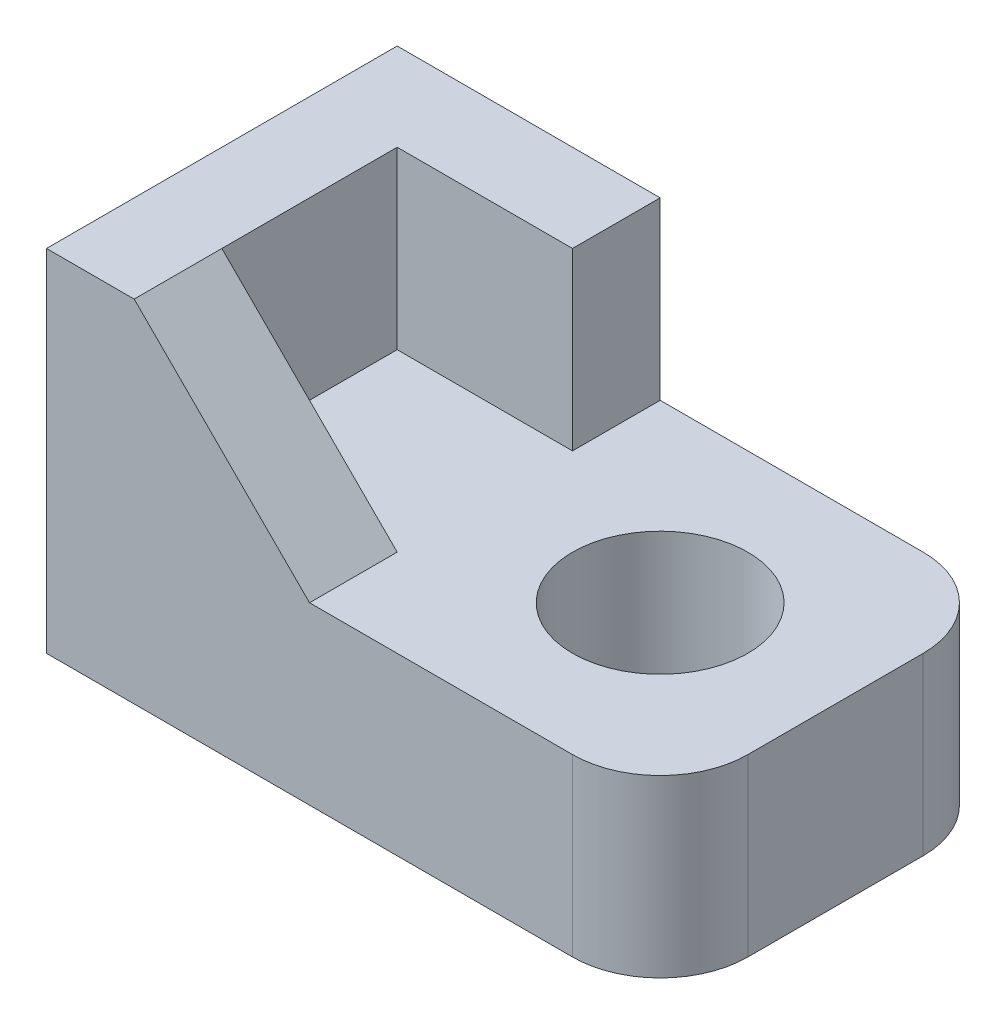
ISO-10303-21;
HEADER;
FILE_DESCRIPTION(('STEP AP214'),'2;1');
FILE_NAME('part.step','',(''),(''),'','','');
FILE_SCHEMA(('AUTOMOTIVE_DESIGN { 1 0 10303 214 1 1 1 1 }'));
ENDSEC;
DATA;
#1=APPLICATION_CONTEXT('core data for automotive mechanical design processes');
#2=APPLICATION_PROTOCOL_DEFINITION('international standard','automotive_design',2000,#1);
#3=PRODUCT_CONTEXT('',#1,'mechanical');
#4=PRODUCT('Part','Part','',(#3));
#5=PRODUCT_RELATED_PRODUCT_CATEGORY('part','',(#4));
#6=PRODUCT_DEFINITION_FORMATION('','',#4);
#7=PRODUCT_DEFINITION_CONTEXT('part definition',#1,'design');
#8=PRODUCT_DEFINITION('design','',#6,#7);
#9=PRODUCT_DEFINITION_SHAPE('','',#8);
#10=(LENGTH_UNIT() NAMED_UNIT(*) SI_UNIT(.MILLI.,.METRE.));
#11=(NAMED_UNIT(*) PLANE_ANGLE_UNIT() SI_UNIT($,.RADIAN.));
#12=(NAMED_UNIT(*) SI_UNIT($,.STERADIAN.) SOLID_ANGLE_UNIT());
#13=UNCERTAINTY_MEASURE_WITH_UNIT(LENGTH_MEASURE(1.E-05),#10,'distance_accuracy_value','');
#14=(GEOMETRIC_REPRESENTATION_CONTEXT(3) GLOBAL_UNCERTAINTY_ASSIGNED_CONTEXT((#13)) GLOBAL_UNIT_ASSIGNED_CONTEXT((#10,
#11,#12)) REPRESENTATION_CONTEXT('',''));
#15=CARTESIAN_POINT('',(0.,0.,0.));
#16=DIRECTION('',(0.,0.,1.));
#17=DIRECTION('',(1.,0.,0.));
#18=AXIS2_PLACEMENT_3D('',#15,#16,#17);
#19=CARTESIAN_POINT('',(6.,2.,-1.));
#20=DIRECTION('',(0.,1.,0.));
#21=DIRECTION('',(0.,0.,1.));
#22=AXIS2_PLACEMENT_3D('',#19,#20,#21);
#23=PLANE('',#22);
#24=DIRECTION('',(0.,0.,-1.));
#25=VECTOR('',#24,1.);
#26=CARTESIAN_POINT('',(3.,2.,-1.));
#27=LINE('',#26,#25);
#28=CARTESIAN_POINT('',(3.,2.,2.));
#29=VERTEX_POINT('',#28);
#30=CARTESIAN_POINT('',(3.,2.,1.));
#31=VERTEX_POINT('',#30);
#32=EDGE_CURVE('E121',#29,#31,#27,.T.);
#33=ORIENTED_EDGE('',*,*,#32,.F.);
#34=DIRECTION('',(1.,0.,0.));
#35=VECTOR('',#34,1.);
#36=CARTESIAN_POINT('',(0.,2.,2.));
#37=LINE('',#36,#35);
#38=CARTESIAN_POINT('',(6.,2.,2.));
#39=VERTEX_POINT('',#38);
#40=EDGE_CURVE('E154',#29,#39,#37,.T.);
#41=ORIENTED_EDGE('',*,*,#40,.T.);
#42=CARTESIAN_POINT('',(6.,2.,1.));
#43=DIRECTION('',(0.,1.,0.));
#44=DIRECTION('',(0.,0.,-1.));
#45=AXIS2_PLACEMENT_3D('',#42,#43,#44);
#46=CIRCLE('',#45,1.);
#47=CARTESIAN_POINT('',(7.,2.,1.));
#48=VERTEX_POINT('',#47);
#49=EDGE_CURVE('E157',#39,#48,#46,.T.);
#50=ORIENTED_EDGE('',*,*,#49,.T.);
#51=DIRECTION('',(0.,0.,-1.));
#52=VECTOR('',#51,1.);
#53=CARTESIAN_POINT('',(7.,2.,0.));
#54=LINE('',#53,#52);
#55=CARTESIAN_POINT('',(7.,2.,-1.));
#56=VERTEX_POINT('',#55);
#57=EDGE_CURVE('E159',#48,#56,#54,.T.);
#58=ORIENTED_EDGE('',*,*,#57,.T.);
#59=CARTESIAN_POINT('',(6.,2.,-1.));
#60=DIRECTION('',(0.,1.,0.));
#61=DIRECTION('',(0.,0.,1.));
#62=AXIS2_PLACEMENT_3D('',#59,#60,#61);
#63=CIRCLE('',#62,1.);
#64=CARTESIAN_POINT('',(6.,2.,-2.));
#65=VERTEX_POINT('',#64);
#66=EDGE_CURVE('E161',#56,#65,#63,.T.);
#67=ORIENTED_EDGE('',*,*,#66,.T.);
#68=DIRECTION('',(-1.,0.,0.));
#69=VECTOR('',#68,1.);
#70=CARTESIAN_POINT('',(0.,2.,-2.));
#71=LINE('',#70,#69);
#72=CARTESIAN_POINT('',(3.,2.,-2.));
#73=VERTEX_POINT('',#72);
#74=EDGE_CURVE('E152',#65,#73,#71,.T.);
#75=ORIENTED_EDGE('',*,*,#74,.T.);
#76=DIRECTION('',(0.,0.,-1.));
#77=VECTOR('',#76,1.);
#78=CARTESIAN_POINT('',(3.,2.,-0.999999999999996));
#79=LINE('',#78,#77);
#80=CARTESIAN_POINT('',(3.,2.,-1.));
#81=VERTEX_POINT('',#80);
#82=EDGE_CURVE('E129',#81,#73,#79,.T.);
#83=ORIENTED_EDGE('',*,*,#82,.F.);
#84=DIRECTION('',(1.,0.,0.));
#85=VECTOR('',#84,1.);
#86=CARTESIAN_POINT('',(6.,2.,-1.));
#87=LINE('',#86,#85);
#88=CARTESIAN_POINT('',(1.,2.,-1.));
#89=VERTEX_POINT('',#88);
#90=EDGE_CURVE('E57',#89,#81,#87,.T.);
#91=ORIENTED_EDGE('',*,*,#90,.F.);
#92=DIRECTION('',(0.,0.,-1.));
#93=VECTOR('',#92,1.);
#94=CARTESIAN_POINT('',(1.,2.,-1.));
#95=LINE('',#94,#93);
#96=CARTESIAN_POINT('',(1.,2.,1.));
#97=VERTEX_POINT('',#96);
#98=EDGE_CURVE('E52',#97,#89,#95,.T.);
#99=ORIENTED_EDGE('',*,*,#98,.F.);
#100=DIRECTION('',(-1.,0.,0.));
#101=VECTOR('',#100,1.);
#102=CARTESIAN_POINT('',(6.,2.,1.));
#103=LINE('',#102,#101);
#104=EDGE_CURVE('E135',#31,#97,#103,.T.);
#105=ORIENTED_EDGE('',*,*,#104,.F.);
#106=EDGE_LOOP('',(#33,#41,#50,#58,#67,#75,#83,#91,#99,#105));
#107=FACE_BOUND('',#106,.T.);
#108=CARTESIAN_POINT('',(5.,2.,0.));
#109=DIRECTION('',(0.,1.,0.));
#110=DIRECTION('',(0.,0.,1.));
#111=AXIS2_PLACEMENT_3D('',#108,#109,#110);
#112=CIRCLE('',#111,1.);
#113=CARTESIAN_POINT('',(5.,2.,1.));
#114=VERTEX_POINT('',#113);
#115=EDGE_CURVE('E144',#114,#114,#112,.T.);
#116=ORIENTED_EDGE('',*,*,#115,.F.);
#117=EDGE_LOOP('',(#116));
#118=FACE_BOUND('',#117,.T.);
#119=ADVANCED_FACE('F37',(#107,#118),#23,.T.);
#120=CARTESIAN_POINT('',(6.,0.,-1.));
#121=DIRECTION('',(0.,1.,0.));
#122=DIRECTION('',(0.,0.,1.));
#123=AXIS2_PLACEMENT_3D('',#120,#121,#122);
#124=PLANE('',#123);
#125=CARTESIAN_POINT('',(6.,0.,1.));
#126=DIRECTION('',(0.,1.,0.));
#127=DIRECTION('',(0.,0.,-1.));
#128=AXIS2_PLACEMENT_3D('',#125,#126,#127);
#129=CIRCLE('',#128,1.);
#130=CARTESIAN_POINT('',(6.,0.,2.));
#131=VERTEX_POINT('',#130);
#132=CARTESIAN_POINT('',(7.,0.,1.));
#133=VERTEX_POINT('',#132);
#134=EDGE_CURVE('E169',#131,#133,#129,.T.);
#135=ORIENTED_EDGE('',*,*,#134,.F.);
#136=DIRECTION('',(1.,0.,0.));
#137=VECTOR('',#136,1.);
#138=CARTESIAN_POINT('',(0.,0.,2.));
#139=LINE('',#138,#137);
#140=CARTESIAN_POINT('',(0.,0.,2.));
#141=VERTEX_POINT('',#140);
#142=EDGE_CURVE('E167',#141,#131,#139,.T.);
#143=ORIENTED_EDGE('',*,*,#142,.F.);
#144=DIRECTION('',(0.,0.,1.));
#145=VECTOR('',#144,1.);
#146=CARTESIAN_POINT('',(0.,0.,2.));
#147=LINE('',#146,#145);
#148=CARTESIAN_POINT('',(0.,0.,-2.));
#149=VERTEX_POINT('',#148);
#150=EDGE_CURVE('E165',#149,#141,#147,.T.);
#151=ORIENTED_EDGE('',*,*,#150,.F.);
#152=DIRECTION('',(-1.,0.,0.));
#153=VECTOR('',#152,1.);
#154=CARTESIAN_POINT('',(0.,0.,-2.));
#155=LINE('',#154,#153);
#156=CARTESIAN_POINT('',(6.,0.,-2.));
#157=VERTEX_POINT('',#156);
#158=EDGE_CURVE('E150',#157,#149,#155,.T.);
#159=ORIENTED_EDGE('',*,*,#158,.F.);
#160=CARTESIAN_POINT('',(6.,0.,-1.));
#161=DIRECTION('',(0.,1.,0.));
#162=DIRECTION('',(0.,0.,1.));
#163=AXIS2_PLACEMENT_3D('',#160,#161,#162);
#164=CIRCLE('',#163,1.);
#165=CARTESIAN_POINT('',(7.,0.,-1.));
#166=VERTEX_POINT('',#165);
#167=EDGE_CURVE('E155',#166,#157,#164,.T.);
#168=ORIENTED_EDGE('',*,*,#167,.F.);
#169=DIRECTION('',(0.,0.,-1.));
#170=VECTOR('',#169,1.);
#171=CARTESIAN_POINT('',(7.,0.,-1.));
#172=LINE('',#171,#170);
#173=EDGE_CURVE('E172',#133,#166,#172,.T.);
#174=ORIENTED_EDGE('',*,*,#173,.F.);
#175=EDGE_LOOP('',(#135,#143,#151,#159,#168,#174));
#176=FACE_BOUND('',#175,.T.);
#177=CARTESIAN_POINT('',(5.,0.,0.));
#178=DIRECTION('',(0.,1.,0.));
#179=DIRECTION('',(0.,0.,1.));
#180=AXIS2_PLACEMENT_3D('',#177,#178,#179);
#181=CIRCLE('',#180,1.);
#182=CARTESIAN_POINT('',(5.,0.,1.));
#183=VERTEX_POINT('',#182);
#184=EDGE_CURVE('E141',#183,#183,#181,.T.);
#185=ORIENTED_EDGE('',*,*,#184,.T.);
#186=EDGE_LOOP('',(#185));
#187=FACE_BOUND('',#186,.T.);
#188=ADVANCED_FACE('F199',(#176,#187),#124,.F.);
#189=CARTESIAN_POINT('',(0.,2.,-2.));
#190=DIRECTION('',(0.,0.,1.));
#191=DIRECTION('',(1.,0.,0.));
#192=AXIS2_PLACEMENT_3D('',#189,#190,#191);
#193=PLANE('',#192);
#194=ORIENTED_EDGE('',*,*,#158,.T.);
#195=DIRECTION('',(0.,-1.,0.));
#196=VECTOR('',#195,1.);
#197=CARTESIAN_POINT('',(0.,2.,-2.));
#198=LINE('',#197,#196);
#199=CARTESIAN_POINT('',(0.,4.,-2.));
#200=VERTEX_POINT('',#199);
#201=EDGE_CURVE('E11',#200,#149,#198,.T.);
#202=ORIENTED_EDGE('',*,*,#201,.F.);
#203=DIRECTION('',(1.,0.,0.));
#204=VECTOR('',#203,1.);
#205=CARTESIAN_POINT('',(0.,4.,-2.));
#206=LINE('',#205,#204);
#207=CARTESIAN_POINT('',(3.,4.,-2.));
#208=VERTEX_POINT('',#207);
#209=EDGE_CURVE('E220',#200,#208,#206,.T.);
#210=ORIENTED_EDGE('',*,*,#209,.T.);
#211=DIRECTION('',(0.,-1.,0.));
#212=VECTOR('',#211,1.);
#213=CARTESIAN_POINT('',(3.,4.,-2.));
#214=LINE('',#213,#212);
#215=EDGE_CURVE('E234',#208,#73,#214,.T.);
#216=ORIENTED_EDGE('',*,*,#215,.T.);
#217=ORIENTED_EDGE('',*,*,#74,.F.);
#218=DIRECTION('',(0.,-1.,0.));
#219=VECTOR('',#218,1.);
#220=CARTESIAN_POINT('',(6.,2.,-2.));
#221=LINE('',#220,#219);
#222=EDGE_CURVE('E163',#65,#157,#221,.T.);
#223=ORIENTED_EDGE('',*,*,#222,.T.);
#224=EDGE_LOOP('',(#194,#202,#210,#216,#217,#223));
#225=FACE_BOUND('',#224,.T.);
#226=ADVANCED_FACE('F39',(#225),#193,.F.);
#227=CARTESIAN_POINT('',(0.,2.,2.));
#228=DIRECTION('',(1.,0.,0.));
#229=DIRECTION('',(0.,0.,-1.));
#230=AXIS2_PLACEMENT_3D('',#227,#228,#229);
#231=PLANE('',#230);
#232=ORIENTED_EDGE('',*,*,#150,.T.);
#233=DIRECTION('',(0.,-1.,0.));
#234=VECTOR('',#233,1.);
#235=CARTESIAN_POINT('',(0.,2.,2.));
#236=LINE('',#235,#234);
#237=CARTESIAN_POINT('',(0.,4.,2.));
#238=VERTEX_POINT('',#237);
#239=EDGE_CURVE('E45',#238,#141,#236,.T.);
#240=ORIENTED_EDGE('',*,*,#239,.F.);
#241=DIRECTION('',(0.,0.,-1.));
#242=VECTOR('',#241,1.);
#243=CARTESIAN_POINT('',(0.,4.,2.));
#244=LINE('',#243,#242);
#245=EDGE_CURVE('E218',#238,#200,#244,.T.);
#246=ORIENTED_EDGE('',*,*,#245,.T.);
#247=ORIENTED_EDGE('',*,*,#201,.T.);
#248=EDGE_LOOP('',(#232,#240,#246,#247));
#249=FACE_BOUND('',#248,.T.);
#250=ADVANCED_FACE('F253',(#249),#231,.F.);
#251=CARTESIAN_POINT('',(0.,2.,2.));
#252=DIRECTION('',(0.,0.,-1.));
#253=DIRECTION('',(-1.,0.,0.));
#254=AXIS2_PLACEMENT_3D('',#251,#252,#253);
#255=PLANE('',#254);
#256=ORIENTED_EDGE('',*,*,#40,.F.);
#257=DIRECTION('',(0.707106781186548,-0.707106781186548,0.));
#258=VECTOR('',#257,1.);
#259=CARTESIAN_POINT('',(3.,2.,2.));
#260=LINE('',#259,#258);
#261=CARTESIAN_POINT('',(1.,4.,2.));
#262=VERTEX_POINT('',#261);
#263=EDGE_CURVE('E127',#262,#29,#260,.T.);
#264=ORIENTED_EDGE('',*,*,#263,.F.);
#265=DIRECTION('',(-1.,0.,0.));
#266=VECTOR('',#265,1.);
#267=CARTESIAN_POINT('',(3.,4.,2.));
#268=LINE('',#267,#266);
#269=EDGE_CURVE('E192',#262,#238,#268,.T.);
#270=ORIENTED_EDGE('',*,*,#269,.T.);
#271=ORIENTED_EDGE('',*,*,#239,.T.);
#272=ORIENTED_EDGE('',*,*,#142,.T.);
#273=DIRECTION('',(0.,-1.,0.));
#274=VECTOR('',#273,1.);
#275=CARTESIAN_POINT('',(6.,2.,2.));
#276=LINE('',#275,#274);
#277=EDGE_CURVE('E183',#39,#131,#276,.T.);
#278=ORIENTED_EDGE('',*,*,#277,.F.);
#279=EDGE_LOOP('',(#256,#264,#270,#271,#272,#278));
#280=FACE_BOUND('',#279,.T.);
#281=ADVANCED_FACE('F189',(#280),#255,.F.);
#282=CARTESIAN_POINT('',(6.,2.,1.));
#283=DIRECTION('',(0.,-1.,0.));
#284=DIRECTION('',(0.,0.,-1.));
#285=AXIS2_PLACEMENT_3D('',#282,#283,#284);
#286=CYLINDRICAL_SURFACE('',#285,1.);
#287=ORIENTED_EDGE('',*,*,#134,.T.);
#288=DIRECTION('',(0.,-1.,0.));
#289=VECTOR('',#288,1.);
#290=CARTESIAN_POINT('',(7.,2.,1.));
#291=LINE('',#290,#289);
#292=EDGE_CURVE('E180',#48,#133,#291,.T.);
#293=ORIENTED_EDGE('',*,*,#292,.F.);
#294=ORIENTED_EDGE('',*,*,#49,.F.);
#295=ORIENTED_EDGE('',*,*,#277,.T.);
#296=EDGE_LOOP('',(#287,#293,#294,#295));
#297=FACE_BOUND('',#296,.T.);
#298=ADVANCED_FACE('F205',(#297),#286,.T.);
#299=CARTESIAN_POINT('',(7.,2.,-1.));
#300=DIRECTION('',(-1.,0.,0.));
#301=DIRECTION('',(0.,0.,1.));
#302=AXIS2_PLACEMENT_3D('',#299,#300,#301);
#303=PLANE('',#302);
#304=ORIENTED_EDGE('',*,*,#173,.T.);
#305=DIRECTION('',(0.,-1.,0.));
#306=VECTOR('',#305,1.);
#307=CARTESIAN_POINT('',(7.,2.,-1.));
#308=LINE('',#307,#306);
#309=EDGE_CURVE('E177',#56,#166,#308,.T.);
#310=ORIENTED_EDGE('',*,*,#309,.F.);
#311=ORIENTED_EDGE('',*,*,#57,.F.);
#312=ORIENTED_EDGE('',*,*,#292,.T.);
#313=EDGE_LOOP('',(#304,#310,#311,#312));
#314=FACE_BOUND('',#313,.T.);
#315=ADVANCED_FACE('F209',(#314),#303,.F.);
#316=CARTESIAN_POINT('',(6.,2.,-1.));
#317=DIRECTION('',(0.,-1.,0.));
#318=DIRECTION('',(0.,0.,-1.));
#319=AXIS2_PLACEMENT_3D('',#316,#317,#318);
#320=CYLINDRICAL_SURFACE('',#319,1.);
#321=ORIENTED_EDGE('',*,*,#167,.T.);
#322=ORIENTED_EDGE('',*,*,#222,.F.);
#323=ORIENTED_EDGE('',*,*,#66,.F.);
#324=ORIENTED_EDGE('',*,*,#309,.T.);
#325=EDGE_LOOP('',(#321,#322,#323,#324));
#326=FACE_BOUND('',#325,.T.);
#327=ADVANCED_FACE('F270',(#326),#320,.T.);
#328=CARTESIAN_POINT('',(5.,2.,0.));
#329=DIRECTION('',(0.,-1.,0.));
#330=DIRECTION('',(0.,0.,-1.));
#331=AXIS2_PLACEMENT_3D('',#328,#329,#330);
#332=CYLINDRICAL_SURFACE('',#331,1.);
#333=ORIENTED_EDGE('',*,*,#115,.T.);
#334=EDGE_LOOP('',(#333));
#335=FACE_BOUND('',#334,.T.);
#336=ORIENTED_EDGE('',*,*,#184,.F.);
#337=EDGE_LOOP('',(#336));
#338=FACE_BOUND('',#337,.T.);
#339=ADVANCED_FACE('F267',(#335,#338),#332,.F.);
#340=CARTESIAN_POINT('',(1.,4.,1.));
#341=DIRECTION('',(0.,0.,-1.));
#342=DIRECTION('',(-1.,0.,0.));
#343=AXIS2_PLACEMENT_3D('',#340,#341,#342);
#344=PLANE('',#343);
#345=DIRECTION('',(0.707106781186548,-0.707106781186548,0.));
#346=VECTOR('',#345,1.);
#347=CARTESIAN_POINT('',(3.,2.,1.));
#348=LINE('',#347,#346);
#349=CARTESIAN_POINT('',(1.,4.,1.));
#350=VERTEX_POINT('',#349);
#351=EDGE_CURVE('E124',#350,#31,#348,.T.);
#352=ORIENTED_EDGE('',*,*,#351,.T.);
#353=ORIENTED_EDGE('',*,*,#104,.T.);
#354=DIRECTION('',(0.,-1.,0.));
#355=VECTOR('',#354,1.);
#356=CARTESIAN_POINT('',(1.,4.,1.));
#357=LINE('',#356,#355);
#358=EDGE_CURVE('E130',#350,#97,#357,.T.);
#359=ORIENTED_EDGE('',*,*,#358,.F.);
#360=EDGE_LOOP('',(#352,#353,#359));
#361=FACE_BOUND('',#360,.T.);
#362=ADVANCED_FACE('F134',(#361),#344,.T.);
#363=CARTESIAN_POINT('',(1.,4.,-1.));
#364=DIRECTION('',(1.,0.,0.));
#365=DIRECTION('',(0.,0.,-1.));
#366=AXIS2_PLACEMENT_3D('',#363,#364,#365);
#367=PLANE('',#366);
#368=ORIENTED_EDGE('',*,*,#358,.T.);
#369=ORIENTED_EDGE('',*,*,#98,.T.);
#370=DIRECTION('',(0.,-1.,0.));
#371=VECTOR('',#370,1.);
#372=CARTESIAN_POINT('',(1.,4.,-1.));
#373=LINE('',#372,#371);
#374=CARTESIAN_POINT('',(1.,4.,-1.));
#375=VERTEX_POINT('',#374);
#376=EDGE_CURVE('E236',#375,#89,#373,.T.);
#377=ORIENTED_EDGE('',*,*,#376,.F.);
#378=DIRECTION('',(0.,0.,1.));
#379=VECTOR('',#378,1.);
#380=CARTESIAN_POINT('',(1.,4.,-1.));
#381=LINE('',#380,#379);
#382=EDGE_CURVE('E232',#375,#350,#381,.T.);
#383=ORIENTED_EDGE('',*,*,#382,.T.);
#384=EDGE_LOOP('',(#368,#369,#377,#383));
#385=FACE_BOUND('',#384,.T.);
#386=ADVANCED_FACE('F302',(#385),#367,.T.);
#387=CARTESIAN_POINT('',(3.,4.,-1.));
#388=DIRECTION('',(0.,0.,1.));
#389=DIRECTION('',(1.,0.,0.));
#390=AXIS2_PLACEMENT_3D('',#387,#388,#389);
#391=PLANE('',#390);
#392=ORIENTED_EDGE('',*,*,#376,.T.);
#393=ORIENTED_EDGE('',*,*,#90,.T.);
#394=DIRECTION('',(0.,-1.,0.));
#395=VECTOR('',#394,1.);
#396=CARTESIAN_POINT('',(3.,4.,-1.));
#397=LINE('',#396,#395);
#398=CARTESIAN_POINT('',(3.,4.,-1.));
#399=VERTEX_POINT('',#398);
#400=EDGE_CURVE('E239',#399,#81,#397,.T.);
#401=ORIENTED_EDGE('',*,*,#400,.F.);
#402=DIRECTION('',(-1.,0.,0.));
#403=VECTOR('',#402,1.);
#404=CARTESIAN_POINT('',(3.,4.,-1.));
#405=LINE('',#404,#403);
#406=EDGE_CURVE('E229',#399,#375,#405,.T.);
#407=ORIENTED_EDGE('',*,*,#406,.T.);
#408=EDGE_LOOP('',(#392,#393,#401,#407));
#409=FACE_BOUND('',#408,.T.);
#410=ADVANCED_FACE('F246',(#409),#391,.T.);
#411=CARTESIAN_POINT('',(3.,4.,-2.));
#412=DIRECTION('',(1.,0.,0.));
#413=DIRECTION('',(0.,0.,-1.));
#414=AXIS2_PLACEMENT_3D('',#411,#412,#413);
#415=PLANE('',#414);
#416=ORIENTED_EDGE('',*,*,#400,.T.);
#417=ORIENTED_EDGE('',*,*,#82,.T.);
#418=ORIENTED_EDGE('',*,*,#215,.F.);
#419=DIRECTION('',(0.,0.,1.));
#420=VECTOR('',#419,1.);
#421=CARTESIAN_POINT('',(3.,4.,-2.));
#422=LINE('',#421,#420);
#423=EDGE_CURVE('E226',#208,#399,#422,.T.);
#424=ORIENTED_EDGE('',*,*,#423,.T.);
#425=EDGE_LOOP('',(#416,#417,#418,#424));
#426=FACE_BOUND('',#425,.T.);
#427=ADVANCED_FACE('F249',(#426),#415,.T.);
#428=CARTESIAN_POINT('',(0.,4.,0.));
#429=DIRECTION('',(0.,-1.,0.));
#430=DIRECTION('',(0.,0.,-1.));
#431=AXIS2_PLACEMENT_3D('',#428,#429,#430);
#432=PLANE('',#431);
#433=ORIENTED_EDGE('',*,*,#269,.F.);
#434=DIRECTION('',(0.,0.,1.));
#435=VECTOR('',#434,1.);
#436=CARTESIAN_POINT('',(1.,4.,1.));
#437=LINE('',#436,#435);
#438=EDGE_CURVE('E138',#350,#262,#437,.T.);
#439=ORIENTED_EDGE('',*,*,#438,.F.);
#440=ORIENTED_EDGE('',*,*,#382,.F.);
#441=ORIENTED_EDGE('',*,*,#406,.F.);
#442=ORIENTED_EDGE('',*,*,#423,.F.);
#443=ORIENTED_EDGE('',*,*,#209,.F.);
#444=ORIENTED_EDGE('',*,*,#245,.F.);
#445=EDGE_LOOP('',(#433,#439,#440,#441,#442,#443,#444));
#446=FACE_BOUND('',#445,.T.);
#447=ADVANCED_FACE('F215',(#446),#432,.F.);
#448=CARTESIAN_POINT('',(3.,2.,1.));
#449=DIRECTION('',(-0.707106781186547,-0.707106781186547,0.));
#450=DIRECTION('',(0.707106781186548,-0.707106781186548,0.));
#451=AXIS2_PLACEMENT_3D('',#448,#449,#450);
#452=PLANE('',#451);
#453=ORIENTED_EDGE('',*,*,#263,.T.);
#454=ORIENTED_EDGE('',*,*,#32,.T.);
#455=ORIENTED_EDGE('',*,*,#351,.F.);
#456=ORIENTED_EDGE('',*,*,#438,.T.);
#457=EDGE_LOOP('',(#453,#454,#455,#456));
#458=FACE_BOUND('',#457,.T.);
#459=ADVANCED_FACE('F123',(#458),#452,.F.);
#460=CLOSED_SHELL('',(#119,#188,#226,#250,#281,#298,#315,#327,#339,#362,#386,#410,#427,#447,#459));
#461=MANIFOLD_SOLID_BREP('B2',#460);
#462=ADVANCED_BREP_SHAPE_REPRESENTATION('',(#18,#461),#14);
#463=SHAPE_DEFINITION_REPRESENTATION(#9,#462);
ENDSEC;
END-ISO-10303-21;
